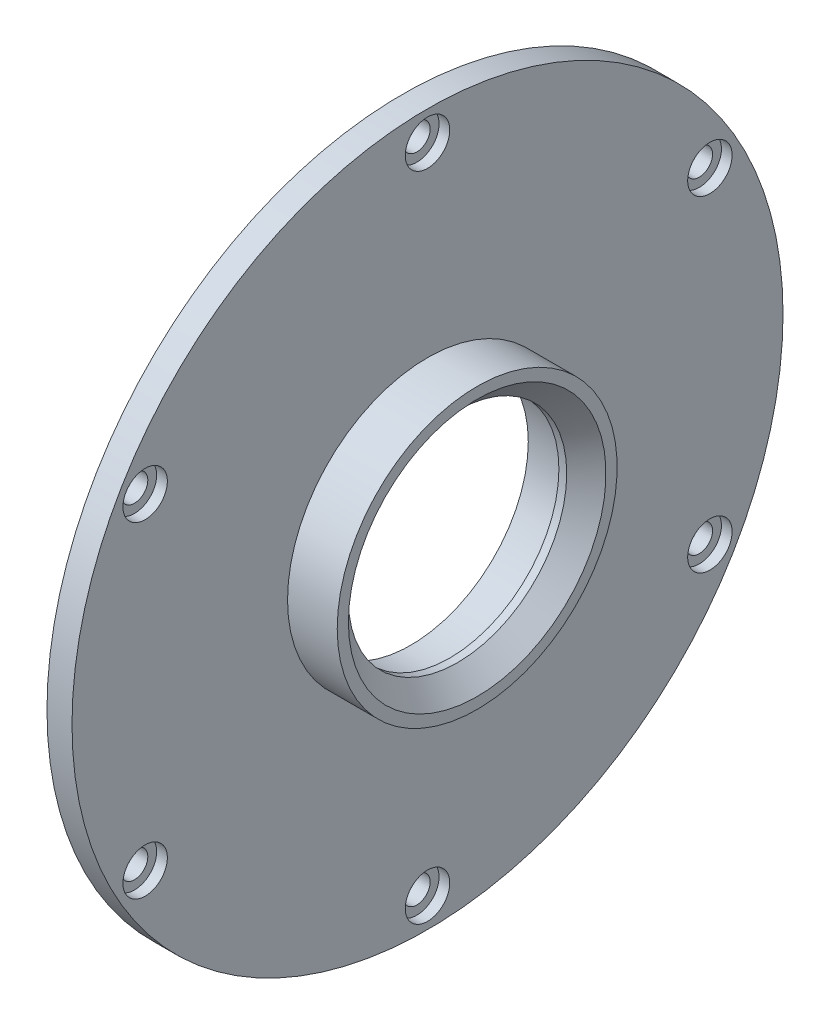
ISO-10303-21;
HEADER;
FILE_DESCRIPTION(('STEP AP214'),'2;1');
FILE_NAME('part.step','',(''),(''),'','','');
FILE_SCHEMA(('AUTOMOTIVE_DESIGN { 1 0 10303 214 1 1 1 1 }'));
ENDSEC;
DATA;
#1=APPLICATION_CONTEXT('core data for automotive mechanical design processes');
#2=APPLICATION_PROTOCOL_DEFINITION('international standard','automotive_design',2000,#1);
#3=PRODUCT_CONTEXT('',#1,'mechanical');
#4=PRODUCT('Part','Part','',(#3));
#5=PRODUCT_RELATED_PRODUCT_CATEGORY('part','',(#4));
#6=PRODUCT_DEFINITION_FORMATION('','',#4);
#7=PRODUCT_DEFINITION_CONTEXT('part definition',#1,'design');
#8=PRODUCT_DEFINITION('design','',#6,#7);
#9=PRODUCT_DEFINITION_SHAPE('','',#8);
#10=(LENGTH_UNIT() NAMED_UNIT(*) SI_UNIT(.MILLI.,.METRE.));
#11=(NAMED_UNIT(*) PLANE_ANGLE_UNIT() SI_UNIT($,.RADIAN.));
#12=(NAMED_UNIT(*) SI_UNIT($,.STERADIAN.) SOLID_ANGLE_UNIT());
#13=UNCERTAINTY_MEASURE_WITH_UNIT(LENGTH_MEASURE(1.E-05),#10,'distance_accuracy_value','');
#14=(GEOMETRIC_REPRESENTATION_CONTEXT(3) GLOBAL_UNCERTAINTY_ASSIGNED_CONTEXT((#13)) GLOBAL_UNIT_ASSIGNED_CONTEXT((#10,
#11,#12)) REPRESENTATION_CONTEXT('',''));
#15=CARTESIAN_POINT('',(0.,0.,0.));
#16=DIRECTION('',(0.,0.,1.));
#17=DIRECTION('',(1.,0.,0.));
#18=AXIS2_PLACEMENT_3D('',#15,#16,#17);
#19=CARTESIAN_POINT('',(34.809800078,25.000000038,0.));
#20=DIRECTION('',(-1.,0.,0.));
#21=DIRECTION('',(0.,0.,1.));
#22=AXIS2_PLACEMENT_3D('',#19,#20,#21);
#23=PLANE('',#22);
#24=CARTESIAN_POINT('',(34.809800078,0.,0.));
#25=DIRECTION('',(-1.,0.,0.));
#26=DIRECTION('',(0.,0.,1.));
#27=AXIS2_PLACEMENT_3D('',#24,#25,#26);
#28=CIRCLE('',#27,25.000000038);
#29=CARTESIAN_POINT('',(34.809800078,0.,25.000000038));
#30=VERTEX_POINT('',#29);
#31=EDGE_CURVE('E10',#30,#30,#28,.T.);
#32=ORIENTED_EDGE('',*,*,#31,.F.);
#33=EDGE_LOOP('',(#32));
#34=FACE_BOUND('',#33,.T.);
#35=CARTESIAN_POINT('',(34.809800078,0.,0.));
#36=DIRECTION('',(-1.,0.,0.));
#37=DIRECTION('',(0.,0.,1.));
#38=AXIS2_PLACEMENT_3D('',#35,#36,#37);
#39=CIRCLE('',#38,22.999999974);
#40=CARTESIAN_POINT('',(34.809800078,0.,22.999999974));
#41=VERTEX_POINT('',#40);
#42=EDGE_CURVE('E42',#41,#41,#39,.T.);
#43=ORIENTED_EDGE('',*,*,#42,.T.);
#44=EDGE_LOOP('',(#43));
#45=FACE_BOUND('',#44,.T.);
#46=ADVANCED_FACE('F35',(#34,#45),#23,.F.);
#47=CARTESIAN_POINT('',(31.309800093,0.,0.));
#48=DIRECTION('',(1.,0.,0.));
#49=DIRECTION('',(0.,0.,-1.));
#50=AXIS2_PLACEMENT_3D('',#47,#48,#49);
#51=CONICAL_SURFACE('',#50,19.499999989,0.785398163397453);
#52=ORIENTED_EDGE('',*,*,#42,.F.);
#53=EDGE_LOOP('',(#52));
#54=FACE_BOUND('',#53,.T.);
#55=CARTESIAN_POINT('',(31.309800093,0.,0.));
#56=DIRECTION('',(-1.,0.,0.));
#57=DIRECTION('',(0.,0.,1.));
#58=AXIS2_PLACEMENT_3D('',#55,#56,#57);
#59=CIRCLE('',#58,19.499999989);
#60=CARTESIAN_POINT('',(31.309800093,0.,19.499999989));
#61=VERTEX_POINT('',#60);
#62=EDGE_CURVE('E47',#61,#61,#59,.T.);
#63=ORIENTED_EDGE('',*,*,#62,.T.);
#64=EDGE_LOOP('',(#63));
#65=FACE_BOUND('',#64,.T.);
#66=ADVANCED_FACE('F145',(#54,#65),#51,.F.);
#67=CARTESIAN_POINT('',(0.,0.,0.));
#68=DIRECTION('',(-1.,0.,0.));
#69=DIRECTION('',(0.,0.,1.));
#70=AXIS2_PLACEMENT_3D('',#67,#68,#69);
#71=CYLINDRICAL_SURFACE('',#70,19.499999989);
#72=ORIENTED_EDGE('',*,*,#62,.F.);
#73=EDGE_LOOP('',(#72));
#74=FACE_BOUND('',#73,.T.);
#75=CARTESIAN_POINT('',(29.909799972,0.,0.));
#76=DIRECTION('',(-1.,0.,0.));
#77=DIRECTION('',(0.,0.,1.));
#78=AXIS2_PLACEMENT_3D('',#75,#76,#77);
#79=CIRCLE('',#78,19.499999989);
#80=CARTESIAN_POINT('',(29.909799972,0.,19.499999989));
#81=VERTEX_POINT('',#80);
#82=EDGE_CURVE('E140',#81,#81,#79,.T.);
#83=ORIENTED_EDGE('',*,*,#82,.T.);
#84=EDGE_LOOP('',(#83));
#85=FACE_BOUND('',#84,.T.);
#86=ADVANCED_FACE('F147',(#74,#85),#71,.F.);
#87=CARTESIAN_POINT('',(29.909799972,19.499999989,0.));
#88=DIRECTION('',(1.,0.,0.));
#89=DIRECTION('',(0.,0.,-1.));
#90=AXIS2_PLACEMENT_3D('',#87,#88,#89);
#91=PLANE('',#90);
#92=ORIENTED_EDGE('',*,*,#82,.F.);
#93=EDGE_LOOP('',(#92));
#94=FACE_BOUND('',#93,.T.);
#95=CARTESIAN_POINT('',(29.909799972,0.,0.));
#96=DIRECTION('',(-1.,0.,0.));
#97=DIRECTION('',(0.,0.,1.));
#98=AXIS2_PLACEMENT_3D('',#95,#96,#97);
#99=CIRCLE('',#98,21.000000037);
#100=CARTESIAN_POINT('',(29.909799972,0.,21.000000037));
#101=VERTEX_POINT('',#100);
#102=EDGE_CURVE('E137',#101,#101,#99,.T.);
#103=ORIENTED_EDGE('',*,*,#102,.T.);
#104=EDGE_LOOP('',(#103));
#105=FACE_BOUND('',#104,.T.);
#106=ADVANCED_FACE('F150',(#94,#105),#91,.F.);
#107=CARTESIAN_POINT('',(0.,0.,0.));
#108=DIRECTION('',(-1.,0.,0.));
#109=DIRECTION('',(0.,0.,1.));
#110=AXIS2_PLACEMENT_3D('',#107,#108,#109);
#111=CYLINDRICAL_SURFACE('',#110,21.000000037);
#112=ORIENTED_EDGE('',*,*,#102,.F.);
#113=EDGE_LOOP('',(#112));
#114=FACE_BOUND('',#113,.T.);
#115=CARTESIAN_POINT('',(22.939799942,0.,0.));
#116=DIRECTION('',(-1.,0.,0.));
#117=DIRECTION('',(0.,0.,1.));
#118=AXIS2_PLACEMENT_3D('',#115,#116,#117);
#119=CIRCLE('',#118,21.000000037);
#120=CARTESIAN_POINT('',(22.939799942,0.,21.000000037));
#121=VERTEX_POINT('',#120);
#122=EDGE_CURVE('E134',#121,#121,#119,.T.);
#123=ORIENTED_EDGE('',*,*,#122,.T.);
#124=EDGE_LOOP('',(#123));
#125=FACE_BOUND('',#124,.T.);
#126=ADVANCED_FACE('F156',(#114,#125),#111,.F.);
#127=CARTESIAN_POINT('',(22.939799942,51.308,0.));
#128=DIRECTION('',(1.,0.,0.));
#129=DIRECTION('',(0.,0.,-1.));
#130=AXIS2_PLACEMENT_3D('',#127,#128,#129);
#131=PLANE('',#130);
#132=ORIENTED_EDGE('',*,*,#122,.F.);
#133=EDGE_LOOP('',(#132));
#134=FACE_BOUND('',#133,.T.);
#135=CARTESIAN_POINT('',(22.939799942,0.,0.));
#136=DIRECTION('',(-1.,0.,0.));
#137=DIRECTION('',(0.,0.,1.));
#138=AXIS2_PLACEMENT_3D('',#135,#136,#137);
#139=CIRCLE('',#138,51.308);
#140=CARTESIAN_POINT('',(22.939799942,0.,51.308));
#141=VERTEX_POINT('',#140);
#142=EDGE_CURVE('E131',#141,#141,#139,.T.);
#143=ORIENTED_EDGE('',*,*,#142,.T.);
#144=EDGE_LOOP('',(#143));
#145=FACE_BOUND('',#144,.T.);
#146=ADVANCED_FACE('F162',(#134,#145),#131,.F.);
#147=CARTESIAN_POINT('',(0.,0.,0.));
#148=DIRECTION('',(-1.,0.,0.));
#149=DIRECTION('',(0.,0.,1.));
#150=AXIS2_PLACEMENT_3D('',#147,#148,#149);
#151=CYLINDRICAL_SURFACE('',#150,51.308);
#152=ORIENTED_EDGE('',*,*,#142,.F.);
#153=EDGE_LOOP('',(#152));
#154=FACE_BOUND('',#153,.T.);
#155=CARTESIAN_POINT('',(21.469400038,0.,0.));
#156=DIRECTION('',(-1.,0.,0.));
#157=DIRECTION('',(0.,0.,1.));
#158=AXIS2_PLACEMENT_3D('',#155,#156,#157);
#159=CIRCLE('',#158,51.308);
#160=CARTESIAN_POINT('',(21.469400038,0.,51.308));
#161=VERTEX_POINT('',#160);
#162=EDGE_CURVE('E128',#161,#161,#159,.T.);
#163=ORIENTED_EDGE('',*,*,#162,.T.);
#164=EDGE_LOOP('',(#163));
#165=FACE_BOUND('',#164,.T.);
#166=ADVANCED_FACE('F168',(#154,#165),#151,.F.);
#167=CARTESIAN_POINT('',(21.469400038,63.5,0.));
#168=DIRECTION('',(1.,0.,0.));
#169=DIRECTION('',(0.,0.,-1.));
#170=AXIS2_PLACEMENT_3D('',#167,#168,#169);
#171=PLANE('',#170);
#172=CARTESIAN_POINT('',(21.469400038,58.238499982,0.));
#173=DIRECTION('',(1.,0.,0.));
#174=DIRECTION('',(0.,0.,-1.));
#175=AXIS2_PLACEMENT_3D('',#172,#173,#174);
#176=CIRCLE('',#175,2.38125);
#177=CARTESIAN_POINT('',(21.469400038,58.238499982,-2.38125));
#178=VERTEX_POINT('',#177);
#179=EDGE_CURVE('E54',#178,#178,#176,.F.);
#180=ORIENTED_EDGE('',*,*,#179,.F.);
#181=EDGE_LOOP('',(#180));
#182=FACE_BOUND('',#181,.T.);
#183=CARTESIAN_POINT('',(21.469400038,29.1192499910113,50.4360204627024));
#184=DIRECTION('',(1.,0.,0.));
#185=DIRECTION('',(0.,0.,-1.));
#186=AXIS2_PLACEMENT_3D('',#183,#184,#185);
#187=CIRCLE('',#186,2.38124999998759);
#188=CARTESIAN_POINT('',(21.469400038,29.1192499910113,48.0547704627148));
#189=VERTEX_POINT('',#188);
#190=EDGE_CURVE('E62',#189,#189,#187,.F.);
#191=ORIENTED_EDGE('',*,*,#190,.F.);
#192=EDGE_LOOP('',(#191));
#193=FACE_BOUND('',#192,.T.);
#194=CARTESIAN_POINT('',(21.469400038,-29.1192499909887,50.4360204627128));
#195=DIRECTION('',(1.,0.,0.));
#196=DIRECTION('',(0.,0.,-1.));
#197=AXIS2_PLACEMENT_3D('',#194,#195,#196);
#198=CIRCLE('',#197,2.38124999999189);
#199=CARTESIAN_POINT('',(21.469400038,-29.1192499909887,48.0547704627209));
#200=VERTEX_POINT('',#199);
#201=EDGE_CURVE('E65',#200,#200,#198,.F.);
#202=ORIENTED_EDGE('',*,*,#201,.F.);
#203=EDGE_LOOP('',(#202));
#204=FACE_BOUND('',#203,.T.);
#205=CARTESIAN_POINT('',(21.469400038,-58.2384999819954,5.15255418399261E-12));
#206=DIRECTION('',(1.,0.,0.));
#207=DIRECTION('',(0.,0.,-1.));
#208=AXIS2_PLACEMENT_3D('',#205,#206,#207);
#209=CIRCLE('',#208,2.38124999999681);
#210=CARTESIAN_POINT('',(21.469400038,-58.2384999819954,-2.38124999999165));
#211=VERTEX_POINT('',#210);
#212=EDGE_CURVE('E68',#211,#211,#209,.F.);
#213=ORIENTED_EDGE('',*,*,#212,.F.);
#214=EDGE_LOOP('',(#213));
#215=FACE_BOUND('',#214,.T.);
#216=CARTESIAN_POINT('',(21.469400038,-29.1192499909999,-50.436020462709));
#217=DIRECTION('',(1.,0.,0.));
#218=DIRECTION('',(0.,0.,-1.));
#219=AXIS2_PLACEMENT_3D('',#216,#217,#218);
#220=CIRCLE('',#219,2.38124999999976);
#221=CARTESIAN_POINT('',(21.469400038,-29.1192499909999,-52.8172704627087));
#222=VERTEX_POINT('',#221);
#223=EDGE_CURVE('E80',#222,#222,#220,.F.);
#224=ORIENTED_EDGE('',*,*,#223,.F.);
#225=EDGE_LOOP('',(#224));
#226=FACE_BOUND('',#225,.T.);
#227=CARTESIAN_POINT('',(21.469400038,29.119249991,-50.4360204627116));
#228=DIRECTION('',(1.,0.,0.));
#229=DIRECTION('',(0.,0.,-1.));
#230=AXIS2_PLACEMENT_3D('',#227,#228,#229);
#231=CIRCLE('',#230,2.3812500000001);
#232=CARTESIAN_POINT('',(21.469400038,29.119249991,-52.8172704627117));
#233=VERTEX_POINT('',#232);
#234=EDGE_CURVE('E58',#233,#233,#231,.F.);
#235=ORIENTED_EDGE('',*,*,#234,.F.);
#236=EDGE_LOOP('',(#235));
#237=FACE_BOUND('',#236,.T.);
#238=ORIENTED_EDGE('',*,*,#162,.F.);
#239=EDGE_LOOP('',(#238));
#240=FACE_BOUND('',#239,.T.);
#241=CARTESIAN_POINT('',(21.469400038,0.,0.));
#242=DIRECTION('',(-1.,0.,0.));
#243=DIRECTION('',(0.,0.,1.));
#244=AXIS2_PLACEMENT_3D('',#241,#242,#243);
#245=CIRCLE('',#244,63.5);
#246=CARTESIAN_POINT('',(21.469400038,0.,63.5));
#247=VERTEX_POINT('',#246);
#248=EDGE_CURVE('E125',#247,#247,#245,.T.);
#249=ORIENTED_EDGE('',*,*,#248,.T.);
#250=EDGE_LOOP('',(#249));
#251=FACE_BOUND('',#250,.T.);
#252=ADVANCED_FACE('F174',(#182,#193,#204,#215,#226,#237,#240,#251),#171,.F.);
#253=CARTESIAN_POINT('',(0.,0.,0.));
#254=DIRECTION('',(-1.,0.,0.));
#255=DIRECTION('',(0.,0.,1.));
#256=AXIS2_PLACEMENT_3D('',#253,#254,#255);
#257=CYLINDRICAL_SURFACE('',#256,63.5);
#258=ORIENTED_EDGE('',*,*,#248,.F.);
#259=EDGE_LOOP('',(#258));
#260=FACE_BOUND('',#259,.T.);
#261=CARTESIAN_POINT('',(25.939800038,0.,0.));
#262=DIRECTION('',(-1.,0.,0.));
#263=DIRECTION('',(0.,0.,1.));
#264=AXIS2_PLACEMENT_3D('',#261,#262,#263);
#265=CIRCLE('',#264,63.5);
#266=CARTESIAN_POINT('',(25.939800038,0.,63.5));
#267=VERTEX_POINT('',#266);
#268=EDGE_CURVE('E122',#267,#267,#265,.T.);
#269=ORIENTED_EDGE('',*,*,#268,.T.);
#270=EDGE_LOOP('',(#269));
#271=FACE_BOUND('',#270,.T.);
#272=ADVANCED_FACE('F180',(#260,#271),#257,.T.);
#273=CARTESIAN_POINT('',(25.939800038,63.5,0.));
#274=DIRECTION('',(-1.,0.,0.));
#275=DIRECTION('',(0.,0.,1.));
#276=AXIS2_PLACEMENT_3D('',#273,#274,#275);
#277=PLANE('',#276);
#278=CARTESIAN_POINT('',(25.939800038,58.238499982,0.));
#279=DIRECTION('',(1.,0.,0.));
#280=DIRECTION('',(0.,0.,-1.));
#281=AXIS2_PLACEMENT_3D('',#278,#279,#280);
#282=CIRCLE('',#281,3.96875);
#283=CARTESIAN_POINT('',(25.939800038,58.238499982,-3.96875));
#284=VERTEX_POINT('',#283);
#285=EDGE_CURVE('E109',#284,#284,#282,.T.);
#286=ORIENTED_EDGE('',*,*,#285,.F.);
#287=EDGE_LOOP('',(#286));
#288=FACE_BOUND('',#287,.T.);
#289=CARTESIAN_POINT('',(25.939800038,29.119249991,-50.4360204627116));
#290=DIRECTION('',(1.,0.,0.));
#291=DIRECTION('',(0.,0.,-1.));
#292=AXIS2_PLACEMENT_3D('',#289,#290,#291);
#293=CIRCLE('',#292,3.9687500000001);
#294=CARTESIAN_POINT('',(25.939800038,29.119249991,-54.4047704627117));
#295=VERTEX_POINT('',#294);
#296=EDGE_CURVE('E103',#295,#295,#293,.T.);
#297=ORIENTED_EDGE('',*,*,#296,.F.);
#298=EDGE_LOOP('',(#297));
#299=FACE_BOUND('',#298,.T.);
#300=CARTESIAN_POINT('',(25.939800038,29.1192499910113,50.4360204627024));
#301=DIRECTION('',(1.,0.,0.));
#302=DIRECTION('',(0.,0.,-1.));
#303=AXIS2_PLACEMENT_3D('',#300,#301,#302);
#304=CIRCLE('',#303,3.96874999998758);
#305=CARTESIAN_POINT('',(25.939800038,29.1192499910113,46.4672704627148));
#306=VERTEX_POINT('',#305);
#307=EDGE_CURVE('E97',#306,#306,#304,.T.);
#308=ORIENTED_EDGE('',*,*,#307,.F.);
#309=EDGE_LOOP('',(#308));
#310=FACE_BOUND('',#309,.T.);
#311=CARTESIAN_POINT('',(25.939800038,-29.1192499909887,50.4360204627128));
#312=DIRECTION('',(1.,0.,0.));
#313=DIRECTION('',(0.,0.,-1.));
#314=AXIS2_PLACEMENT_3D('',#311,#312,#313);
#315=CIRCLE('',#314,3.96874999999189);
#316=CARTESIAN_POINT('',(25.939800038,-29.1192499909887,46.4672704627209));
#317=VERTEX_POINT('',#316);
#318=EDGE_CURVE('E91',#317,#317,#315,.T.);
#319=ORIENTED_EDGE('',*,*,#318,.F.);
#320=EDGE_LOOP('',(#319));
#321=FACE_BOUND('',#320,.T.);
#322=CARTESIAN_POINT('',(25.939800038,-58.2384999819954,5.15255418399261E-12));
#323=DIRECTION('',(1.,0.,0.));
#324=DIRECTION('',(0.,0.,-1.));
#325=AXIS2_PLACEMENT_3D('',#322,#323,#324);
#326=CIRCLE('',#325,3.96874999999681);
#327=CARTESIAN_POINT('',(25.939800038,-58.2384999819954,-3.96874999999165));
#328=VERTEX_POINT('',#327);
#329=EDGE_CURVE('E84',#328,#328,#326,.T.);
#330=ORIENTED_EDGE('',*,*,#329,.F.);
#331=EDGE_LOOP('',(#330));
#332=FACE_BOUND('',#331,.T.);
#333=CARTESIAN_POINT('',(25.939800038,-29.1192499909999,-50.436020462709));
#334=DIRECTION('',(1.,0.,0.));
#335=DIRECTION('',(0.,0.,-1.));
#336=AXIS2_PLACEMENT_3D('',#333,#334,#335);
#337=CIRCLE('',#336,3.96874999999976);
#338=CARTESIAN_POINT('',(25.939800038,-29.1192499909999,-54.4047704627087));
#339=VERTEX_POINT('',#338);
#340=EDGE_CURVE('E87',#339,#339,#337,.T.);
#341=ORIENTED_EDGE('',*,*,#340,.F.);
#342=EDGE_LOOP('',(#341));
#343=FACE_BOUND('',#342,.T.);
#344=ORIENTED_EDGE('',*,*,#268,.F.);
#345=EDGE_LOOP('',(#344));
#346=FACE_BOUND('',#345,.T.);
#347=CARTESIAN_POINT('',(25.939800038,0.,0.));
#348=DIRECTION('',(-1.,0.,0.));
#349=DIRECTION('',(0.,0.,1.));
#350=AXIS2_PLACEMENT_3D('',#347,#348,#349);
#351=CIRCLE('',#350,25.000000038);
#352=CARTESIAN_POINT('',(25.939800038,0.,25.000000038));
#353=VERTEX_POINT('',#352);
#354=EDGE_CURVE('E117',#353,#353,#351,.T.);
#355=ORIENTED_EDGE('',*,*,#354,.T.);
#356=EDGE_LOOP('',(#355));
#357=FACE_BOUND('',#356,.T.);
#358=ADVANCED_FACE('F187',(#288,#299,#310,#321,#332,#343,#346,#357),#277,.F.);
#359=CARTESIAN_POINT('',(0.,0.,0.));
#360=DIRECTION('',(-1.,0.,0.));
#361=DIRECTION('',(0.,0.,1.));
#362=AXIS2_PLACEMENT_3D('',#359,#360,#361);
#363=CYLINDRICAL_SURFACE('',#362,25.000000038);
#364=ORIENTED_EDGE('',*,*,#354,.F.);
#365=EDGE_LOOP('',(#364));
#366=FACE_BOUND('',#365,.T.);
#367=ORIENTED_EDGE('',*,*,#31,.T.);
#368=EDGE_LOOP('',(#367));
#369=FACE_BOUND('',#368,.T.);
#370=ADVANCED_FACE('F193',(#366,#369),#363,.T.);
#371=CARTESIAN_POINT('',(24.034800038,-29.1192499909999,-50.436020462709));
#372=DIRECTION('',(1.,0.,0.));
#373=DIRECTION('',(0.,0.,-1.));
#374=AXIS2_PLACEMENT_3D('',#371,#372,#373);
#375=CYLINDRICAL_SURFACE('',#374,3.96874999999976);
#376=CARTESIAN_POINT('',(24.034800038,-29.1192499909999,-50.436020462709));
#377=DIRECTION('',(1.,0.,0.));
#378=DIRECTION('',(0.,0.,-1.));
#379=AXIS2_PLACEMENT_3D('',#376,#377,#378);
#380=CIRCLE('',#379,3.96874999999976);
#381=CARTESIAN_POINT('',(24.034800038,-29.1192499909999,-54.4047704627087));
#382=VERTEX_POINT('',#381);
#383=EDGE_CURVE('E114',#382,#382,#380,.T.);
#384=ORIENTED_EDGE('',*,*,#383,.F.);
#385=EDGE_LOOP('',(#384));
#386=FACE_BOUND('',#385,.T.);
#387=ORIENTED_EDGE('',*,*,#340,.T.);
#388=EDGE_LOOP('',(#387));
#389=FACE_BOUND('',#388,.T.);
#390=ADVANCED_FACE('F199',(#386,#389),#375,.F.);
#391=CARTESIAN_POINT('',(24.034800038,-29.1192499909999,-50.436020462709));
#392=DIRECTION('',(1.,0.,0.));
#393=DIRECTION('',(0.,0.,-1.));
#394=AXIS2_PLACEMENT_3D('',#391,#392,#393);
#395=PLANE('',#394);
#396=CARTESIAN_POINT('',(24.034800038,-29.1192499909999,-50.436020462709));
#397=DIRECTION('',(1.,0.,0.));
#398=DIRECTION('',(0.,0.,-1.));
#399=AXIS2_PLACEMENT_3D('',#396,#397,#398);
#400=CIRCLE('',#399,2.38124999999976);
#401=CARTESIAN_POINT('',(24.034800038,-29.1192499909999,-52.8172704627087));
#402=VERTEX_POINT('',#401);
#403=EDGE_CURVE('E38',#402,#402,#400,.F.);
#404=ORIENTED_EDGE('',*,*,#403,.T.);
#405=EDGE_LOOP('',(#404));
#406=FACE_BOUND('',#405,.T.);
#407=ORIENTED_EDGE('',*,*,#383,.T.);
#408=EDGE_LOOP('',(#407));
#409=FACE_BOUND('',#408,.T.);
#410=ADVANCED_FACE('F204',(#406,#409),#395,.T.);
#411=CARTESIAN_POINT('',(24.034800038,-58.2384999819954,5.15255418399261E-12));
#412=DIRECTION('',(1.,0.,0.));
#413=DIRECTION('',(0.,0.,-1.));
#414=AXIS2_PLACEMENT_3D('',#411,#412,#413);
#415=CYLINDRICAL_SURFACE('',#414,3.96874999999681);
#416=CARTESIAN_POINT('',(24.034800038,-58.2384999819954,5.15255418399261E-12));
#417=DIRECTION('',(1.,0.,0.));
#418=DIRECTION('',(0.,0.,-1.));
#419=AXIS2_PLACEMENT_3D('',#416,#417,#418);
#420=CIRCLE('',#419,3.96874999999681);
#421=CARTESIAN_POINT('',(24.034800038,-58.2384999819954,-3.96874999999165));
#422=VERTEX_POINT('',#421);
#423=EDGE_CURVE('E88',#422,#422,#420,.T.);
#424=ORIENTED_EDGE('',*,*,#423,.F.);
#425=EDGE_LOOP('',(#424));
#426=FACE_BOUND('',#425,.T.);
#427=ORIENTED_EDGE('',*,*,#329,.T.);
#428=EDGE_LOOP('',(#427));
#429=FACE_BOUND('',#428,.T.);
#430=ADVANCED_FACE('F269',(#426,#429),#415,.F.);
#431=CARTESIAN_POINT('',(24.034800038,-58.2384999819954,5.15255418399261E-12));
#432=DIRECTION('',(1.,0.,0.));
#433=DIRECTION('',(0.,0.,-1.));
#434=AXIS2_PLACEMENT_3D('',#431,#432,#433);
#435=PLANE('',#434);
#436=CARTESIAN_POINT('',(24.034800038,-58.2384999819954,5.15255418399261E-12));
#437=DIRECTION('',(1.,0.,0.));
#438=DIRECTION('',(0.,0.,-1.));
#439=AXIS2_PLACEMENT_3D('',#436,#437,#438);
#440=CIRCLE('',#439,2.38124999999681);
#441=CARTESIAN_POINT('',(24.034800038,-58.2384999819954,-2.38124999999165));
#442=VERTEX_POINT('',#441);
#443=EDGE_CURVE('E66',#442,#442,#440,.F.);
#444=ORIENTED_EDGE('',*,*,#443,.T.);
#445=EDGE_LOOP('',(#444));
#446=FACE_BOUND('',#445,.T.);
#447=ORIENTED_EDGE('',*,*,#423,.T.);
#448=EDGE_LOOP('',(#447));
#449=FACE_BOUND('',#448,.T.);
#450=ADVANCED_FACE('F274',(#446,#449),#435,.T.);
#451=CARTESIAN_POINT('',(24.034800038,-29.1192499909887,50.4360204627128));
#452=DIRECTION('',(1.,0.,0.));
#453=DIRECTION('',(0.,0.,-1.));
#454=AXIS2_PLACEMENT_3D('',#451,#452,#453);
#455=CYLINDRICAL_SURFACE('',#454,3.96874999999189);
#456=CARTESIAN_POINT('',(24.034800038,-29.1192499909887,50.4360204627128));
#457=DIRECTION('',(1.,0.,0.));
#458=DIRECTION('',(0.,0.,-1.));
#459=AXIS2_PLACEMENT_3D('',#456,#457,#458);
#460=CIRCLE('',#459,3.96874999999189);
#461=CARTESIAN_POINT('',(24.034800038,-29.1192499909887,46.4672704627209));
#462=VERTEX_POINT('',#461);
#463=EDGE_CURVE('E94',#462,#462,#460,.T.);
#464=ORIENTED_EDGE('',*,*,#463,.F.);
#465=EDGE_LOOP('',(#464));
#466=FACE_BOUND('',#465,.T.);
#467=ORIENTED_EDGE('',*,*,#318,.T.);
#468=EDGE_LOOP('',(#467));
#469=FACE_BOUND('',#468,.T.);
#470=ADVANCED_FACE('F283',(#466,#469),#455,.F.);
#471=CARTESIAN_POINT('',(24.034800038,-29.1192499909887,50.4360204627128));
#472=DIRECTION('',(1.,0.,0.));
#473=DIRECTION('',(0.,0.,-1.));
#474=AXIS2_PLACEMENT_3D('',#471,#472,#473);
#475=PLANE('',#474);
#476=CARTESIAN_POINT('',(24.034800038,-29.1192499909887,50.4360204627128));
#477=DIRECTION('',(1.,0.,0.));
#478=DIRECTION('',(0.,0.,-1.));
#479=AXIS2_PLACEMENT_3D('',#476,#477,#478);
#480=CIRCLE('',#479,2.38124999999189);
#481=CARTESIAN_POINT('',(24.034800038,-29.1192499909887,48.0547704627209));
#482=VERTEX_POINT('',#481);
#483=EDGE_CURVE('E63',#482,#482,#480,.F.);
#484=ORIENTED_EDGE('',*,*,#483,.T.);
#485=EDGE_LOOP('',(#484));
#486=FACE_BOUND('',#485,.T.);
#487=ORIENTED_EDGE('',*,*,#463,.T.);
#488=EDGE_LOOP('',(#487));
#489=FACE_BOUND('',#488,.T.);
#490=ADVANCED_FACE('F288',(#486,#489),#475,.T.);
#491=CARTESIAN_POINT('',(24.034800038,29.1192499910113,50.4360204627024));
#492=DIRECTION('',(1.,0.,0.));
#493=DIRECTION('',(0.,0.,-1.));
#494=AXIS2_PLACEMENT_3D('',#491,#492,#493);
#495=CYLINDRICAL_SURFACE('',#494,3.96874999998758);
#496=CARTESIAN_POINT('',(24.034800038,29.1192499910113,50.4360204627024));
#497=DIRECTION('',(1.,0.,0.));
#498=DIRECTION('',(0.,0.,-1.));
#499=AXIS2_PLACEMENT_3D('',#496,#497,#498);
#500=CIRCLE('',#499,3.96874999998758);
#501=CARTESIAN_POINT('',(24.034800038,29.1192499910113,46.4672704627148));
#502=VERTEX_POINT('',#501);
#503=EDGE_CURVE('E100',#502,#502,#500,.T.);
#504=ORIENTED_EDGE('',*,*,#503,.F.);
#505=EDGE_LOOP('',(#504));
#506=FACE_BOUND('',#505,.T.);
#507=ORIENTED_EDGE('',*,*,#307,.T.);
#508=EDGE_LOOP('',(#507));
#509=FACE_BOUND('',#508,.T.);
#510=ADVANCED_FACE('F297',(#506,#509),#495,.F.);
#511=CARTESIAN_POINT('',(24.034800038,29.1192499910113,50.4360204627024));
#512=DIRECTION('',(1.,0.,0.));
#513=DIRECTION('',(0.,0.,-1.));
#514=AXIS2_PLACEMENT_3D('',#511,#512,#513);
#515=PLANE('',#514);
#516=CARTESIAN_POINT('',(24.034800038,29.1192499910113,50.4360204627024));
#517=DIRECTION('',(1.,0.,0.));
#518=DIRECTION('',(0.,0.,-1.));
#519=AXIS2_PLACEMENT_3D('',#516,#517,#518);
#520=CIRCLE('',#519,2.38124999998759);
#521=CARTESIAN_POINT('',(24.034800038,29.1192499910113,48.0547704627148));
#522=VERTEX_POINT('',#521);
#523=EDGE_CURVE('E59',#522,#522,#520,.F.);
#524=ORIENTED_EDGE('',*,*,#523,.T.);
#525=EDGE_LOOP('',(#524));
#526=FACE_BOUND('',#525,.T.);
#527=ORIENTED_EDGE('',*,*,#503,.T.);
#528=EDGE_LOOP('',(#527));
#529=FACE_BOUND('',#528,.T.);
#530=ADVANCED_FACE('F302',(#526,#529),#515,.T.);
#531=CARTESIAN_POINT('',(24.034800038,29.119249991,-50.4360204627116));
#532=DIRECTION('',(1.,0.,0.));
#533=DIRECTION('',(0.,0.,-1.));
#534=AXIS2_PLACEMENT_3D('',#531,#532,#533);
#535=CYLINDRICAL_SURFACE('',#534,3.9687500000001);
#536=CARTESIAN_POINT('',(24.034800038,29.119249991,-50.4360204627116));
#537=DIRECTION('',(1.,0.,0.));
#538=DIRECTION('',(0.,0.,-1.));
#539=AXIS2_PLACEMENT_3D('',#536,#537,#538);
#540=CIRCLE('',#539,3.9687500000001);
#541=CARTESIAN_POINT('',(24.034800038,29.119249991,-54.4047704627117));
#542=VERTEX_POINT('',#541);
#543=EDGE_CURVE('E106',#542,#542,#540,.T.);
#544=ORIENTED_EDGE('',*,*,#543,.F.);
#545=EDGE_LOOP('',(#544));
#546=FACE_BOUND('',#545,.T.);
#547=ORIENTED_EDGE('',*,*,#296,.T.);
#548=EDGE_LOOP('',(#547));
#549=FACE_BOUND('',#548,.T.);
#550=ADVANCED_FACE('F311',(#546,#549),#535,.F.);
#551=CARTESIAN_POINT('',(24.034800038,29.119249991,-50.4360204627116));
#552=DIRECTION('',(1.,0.,0.));
#553=DIRECTION('',(0.,0.,-1.));
#554=AXIS2_PLACEMENT_3D('',#551,#552,#553);
#555=PLANE('',#554);
#556=CARTESIAN_POINT('',(24.034800038,29.119249991,-50.4360204627116));
#557=DIRECTION('',(1.,0.,0.));
#558=DIRECTION('',(0.,0.,-1.));
#559=AXIS2_PLACEMENT_3D('',#556,#557,#558);
#560=CIRCLE('',#559,2.3812500000001);
#561=CARTESIAN_POINT('',(24.034800038,29.119249991,-52.8172704627117));
#562=VERTEX_POINT('',#561);
#563=EDGE_CURVE('E55',#562,#562,#560,.F.);
#564=ORIENTED_EDGE('',*,*,#563,.T.);
#565=EDGE_LOOP('',(#564));
#566=FACE_BOUND('',#565,.T.);
#567=ORIENTED_EDGE('',*,*,#543,.T.);
#568=EDGE_LOOP('',(#567));
#569=FACE_BOUND('',#568,.T.);
#570=ADVANCED_FACE('F315',(#566,#569),#555,.T.);
#571=CARTESIAN_POINT('',(24.034800038,58.238499982,0.));
#572=DIRECTION('',(1.,0.,0.));
#573=DIRECTION('',(0.,0.,-1.));
#574=AXIS2_PLACEMENT_3D('',#571,#572,#573);
#575=CYLINDRICAL_SURFACE('',#574,3.96875);
#576=CARTESIAN_POINT('',(24.034800038,58.238499982,0.));
#577=DIRECTION('',(1.,0.,0.));
#578=DIRECTION('',(0.,0.,-1.));
#579=AXIS2_PLACEMENT_3D('',#576,#577,#578);
#580=CIRCLE('',#579,3.96875);
#581=CARTESIAN_POINT('',(24.034800038,58.238499982,-3.96875));
#582=VERTEX_POINT('',#581);
#583=EDGE_CURVE('E83',#582,#582,#580,.T.);
#584=ORIENTED_EDGE('',*,*,#583,.F.);
#585=EDGE_LOOP('',(#584));
#586=FACE_BOUND('',#585,.T.);
#587=ORIENTED_EDGE('',*,*,#285,.T.);
#588=EDGE_LOOP('',(#587));
#589=FACE_BOUND('',#588,.T.);
#590=ADVANCED_FACE('F324',(#586,#589),#575,.F.);
#591=CARTESIAN_POINT('',(24.034800038,58.238499982,0.));
#592=DIRECTION('',(1.,0.,0.));
#593=DIRECTION('',(0.,0.,-1.));
#594=AXIS2_PLACEMENT_3D('',#591,#592,#593);
#595=PLANE('',#594);
#596=CARTESIAN_POINT('',(24.034800038,58.238499982,0.));
#597=DIRECTION('',(1.,0.,0.));
#598=DIRECTION('',(0.,0.,-1.));
#599=AXIS2_PLACEMENT_3D('',#596,#597,#598);
#600=CIRCLE('',#599,2.38125);
#601=CARTESIAN_POINT('',(24.034800038,58.238499982,-2.38125));
#602=VERTEX_POINT('',#601);
#603=EDGE_CURVE('E51',#602,#602,#600,.F.);
#604=ORIENTED_EDGE('',*,*,#603,.T.);
#605=EDGE_LOOP('',(#604));
#606=FACE_BOUND('',#605,.T.);
#607=ORIENTED_EDGE('',*,*,#583,.T.);
#608=EDGE_LOOP('',(#607));
#609=FACE_BOUND('',#608,.T.);
#610=ADVANCED_FACE('F328',(#606,#609),#595,.T.);
#611=CARTESIAN_POINT('',(34.809800078,58.238499982,0.));
#612=DIRECTION('',(-1.,0.,0.));
#613=DIRECTION('',(0.,0.,1.));
#614=AXIS2_PLACEMENT_3D('',#611,#612,#613);
#615=CYLINDRICAL_SURFACE('',#614,2.38125);
#616=ORIENTED_EDGE('',*,*,#603,.F.);
#617=EDGE_LOOP('',(#616));
#618=FACE_BOUND('',#617,.T.);
#619=ORIENTED_EDGE('',*,*,#179,.T.);
#620=EDGE_LOOP('',(#619));
#621=FACE_BOUND('',#620,.T.);
#622=ADVANCED_FACE('F342',(#618,#621),#615,.F.);
#623=CARTESIAN_POINT('',(34.809800078,29.119249991,-50.4360204627116));
#624=DIRECTION('',(-1.,0.,0.));
#625=DIRECTION('',(0.,0.,1.));
#626=AXIS2_PLACEMENT_3D('',#623,#624,#625);
#627=CYLINDRICAL_SURFACE('',#626,2.3812500000001);
#628=ORIENTED_EDGE('',*,*,#563,.F.);
#629=EDGE_LOOP('',(#628));
#630=FACE_BOUND('',#629,.T.);
#631=ORIENTED_EDGE('',*,*,#234,.T.);
#632=EDGE_LOOP('',(#631));
#633=FACE_BOUND('',#632,.T.);
#634=ADVANCED_FACE('F349',(#630,#633),#627,.F.);
#635=CARTESIAN_POINT('',(34.809800078,29.1192499910113,50.4360204627024));
#636=DIRECTION('',(-1.,0.,0.));
#637=DIRECTION('',(0.,0.,1.));
#638=AXIS2_PLACEMENT_3D('',#635,#636,#637);
#639=CYLINDRICAL_SURFACE('',#638,2.38124999998759);
#640=ORIENTED_EDGE('',*,*,#523,.F.);
#641=EDGE_LOOP('',(#640));
#642=FACE_BOUND('',#641,.T.);
#643=ORIENTED_EDGE('',*,*,#190,.T.);
#644=EDGE_LOOP('',(#643));
#645=FACE_BOUND('',#644,.T.);
#646=ADVANCED_FACE('F357',(#642,#645),#639,.F.);
#647=CARTESIAN_POINT('',(34.809800078,-29.1192499909887,50.4360204627128));
#648=DIRECTION('',(-1.,0.,0.));
#649=DIRECTION('',(0.,0.,1.));
#650=AXIS2_PLACEMENT_3D('',#647,#648,#649);
#651=CYLINDRICAL_SURFACE('',#650,2.38124999999189);
#652=ORIENTED_EDGE('',*,*,#483,.F.);
#653=EDGE_LOOP('',(#652));
#654=FACE_BOUND('',#653,.T.);
#655=ORIENTED_EDGE('',*,*,#201,.T.);
#656=EDGE_LOOP('',(#655));
#657=FACE_BOUND('',#656,.T.);
#658=ADVANCED_FACE('F365',(#654,#657),#651,.F.);
#659=CARTESIAN_POINT('',(34.809800078,-58.2384999819954,5.15255418399261E-12));
#660=DIRECTION('',(-1.,0.,0.));
#661=DIRECTION('',(0.,0.,1.));
#662=AXIS2_PLACEMENT_3D('',#659,#660,#661);
#663=CYLINDRICAL_SURFACE('',#662,2.38124999999681);
#664=ORIENTED_EDGE('',*,*,#443,.F.);
#665=EDGE_LOOP('',(#664));
#666=FACE_BOUND('',#665,.T.);
#667=ORIENTED_EDGE('',*,*,#212,.T.);
#668=EDGE_LOOP('',(#667));
#669=FACE_BOUND('',#668,.T.);
#670=ADVANCED_FACE('F373',(#666,#669),#663,.F.);
#671=CARTESIAN_POINT('',(34.809800078,-29.1192499909999,-50.436020462709));
#672=DIRECTION('',(-1.,0.,0.));
#673=DIRECTION('',(0.,0.,1.));
#674=AXIS2_PLACEMENT_3D('',#671,#672,#673);
#675=CYLINDRICAL_SURFACE('',#674,2.38124999999976);
#676=ORIENTED_EDGE('',*,*,#403,.F.);
#677=EDGE_LOOP('',(#676));
#678=FACE_BOUND('',#677,.T.);
#679=ORIENTED_EDGE('',*,*,#223,.T.);
#680=EDGE_LOOP('',(#679));
#681=FACE_BOUND('',#680,.T.);
#682=ADVANCED_FACE('F381',(#678,#681),#675,.F.);
#683=CLOSED_SHELL('',(#46,#66,#86,#106,#126,#146,#166,#252,#272,#358,#370,#390,#410,#430,#450,
#470,#490,#510,#530,#550,#570,#590,#610,#622,#634,#646,#658,#670,#682));
#684=MANIFOLD_SOLID_BREP('B2',#683);
#685=ADVANCED_BREP_SHAPE_REPRESENTATION('',(#18,#684),#14);
#686=SHAPE_DEFINITION_REPRESENTATION(#9,#685);
ENDSEC;
END-ISO-10303-21;
